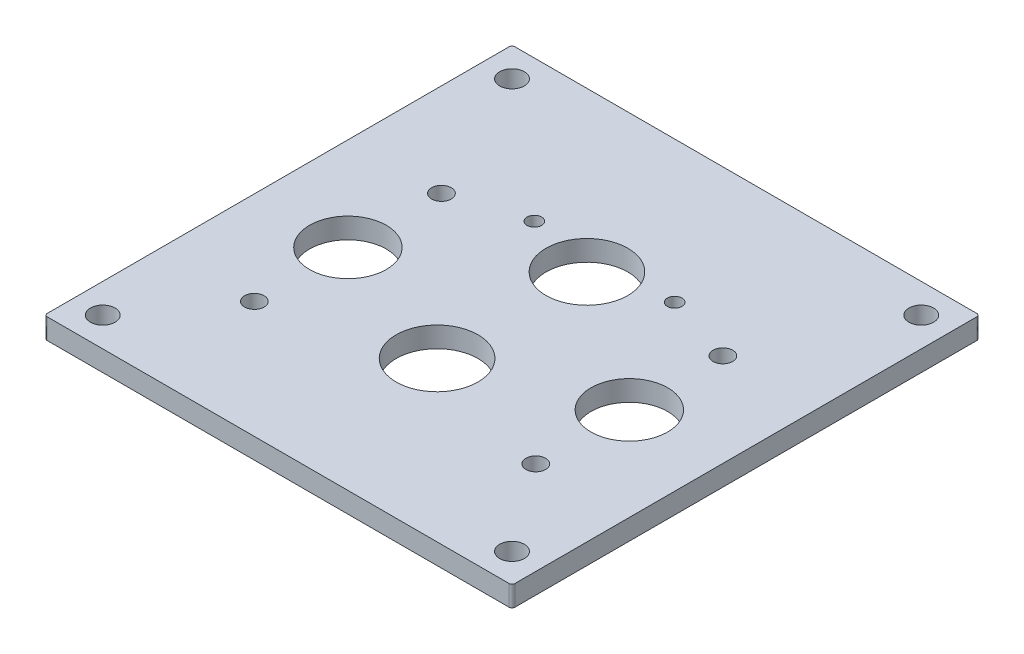
ISO-10303-21;
HEADER;
FILE_DESCRIPTION(('STEP AP214'),'2;1');
FILE_NAME('part.step','',(''),(''),'','','');
FILE_SCHEMA(('AUTOMOTIVE_DESIGN { 1 0 10303 214 1 1 1 1 }'));
ENDSEC;
DATA;
#1=APPLICATION_CONTEXT('core data for automotive mechanical design processes');
#2=APPLICATION_PROTOCOL_DEFINITION('international standard','automotive_design',2000,#1);
#3=PRODUCT_CONTEXT('',#1,'mechanical');
#4=PRODUCT('Part','Part','',(#3));
#5=PRODUCT_RELATED_PRODUCT_CATEGORY('part','',(#4));
#6=PRODUCT_DEFINITION_FORMATION('','',#4);
#7=PRODUCT_DEFINITION_CONTEXT('part definition',#1,'design');
#8=PRODUCT_DEFINITION('design','',#6,#7);
#9=PRODUCT_DEFINITION_SHAPE('','',#8);
#10=(LENGTH_UNIT() NAMED_UNIT(*) SI_UNIT(.MILLI.,.METRE.));
#11=(NAMED_UNIT(*) PLANE_ANGLE_UNIT() SI_UNIT($,.RADIAN.));
#12=(NAMED_UNIT(*) SI_UNIT($,.STERADIAN.) SOLID_ANGLE_UNIT());
#13=UNCERTAINTY_MEASURE_WITH_UNIT(LENGTH_MEASURE(1.E-05),#10,'distance_accuracy_value','');
#14=(GEOMETRIC_REPRESENTATION_CONTEXT(3) GLOBAL_UNCERTAINTY_ASSIGNED_CONTEXT((#13)) GLOBAL_UNIT_ASSIGNED_CONTEXT((#10,
#11,#12)) REPRESENTATION_CONTEXT('',''));
#15=CARTESIAN_POINT('',(0.,0.,0.));
#16=DIRECTION('',(0.,0.,1.));
#17=DIRECTION('',(1.,0.,0.));
#18=AXIS2_PLACEMENT_3D('',#15,#16,#17);
#19=CARTESIAN_POINT('',(76.3793482367759,0.,47.8960232997481));
#20=DIRECTION('',(0.,-1.,0.));
#21=DIRECTION('',(0.,0.,-1.));
#22=AXIS2_PLACEMENT_3D('',#19,#20,#21);
#23=CYLINDRICAL_SURFACE('',#22,0.793749999999989);
#24=CARTESIAN_POINT('',(76.3793482367759,0.,47.8960232997481));
#25=DIRECTION('',(0.,-1.,0.));
#26=DIRECTION('',(0.,0.,-1.));
#27=AXIS2_PLACEMENT_3D('',#24,#25,#26);
#28=CIRCLE('',#27,0.793749999999989);
#29=CARTESIAN_POINT('',(77.1730982367758,0.,47.8960232997481));
#30=VERTEX_POINT('',#29);
#31=CARTESIAN_POINT('',(76.3793482367759,0.,48.6897732997481));
#32=VERTEX_POINT('',#31);
#33=EDGE_CURVE('E85',#30,#32,#28,.T.);
#34=ORIENTED_EDGE('',*,*,#33,.T.);
#35=DIRECTION('',(0.,1.,0.));
#36=VECTOR('',#35,1.);
#37=CARTESIAN_POINT('',(76.3793482367759,0.,48.6897732997481));
#38=LINE('',#37,#36);
#39=CARTESIAN_POINT('',(76.3793482367759,-5.588,48.6897732997481));
#40=VERTEX_POINT('',#39);
#41=EDGE_CURVE('E120',#40,#32,#38,.T.);
#42=ORIENTED_EDGE('',*,*,#41,.F.);
#43=CARTESIAN_POINT('',(76.3793482367759,-5.588,47.8960232997481));
#44=DIRECTION('',(0.,-1.,0.));
#45=DIRECTION('',(0.,0.,-1.));
#46=AXIS2_PLACEMENT_3D('',#43,#44,#45);
#47=CIRCLE('',#46,0.793749999999989);
#48=CARTESIAN_POINT('',(77.1730982367758,-5.588,47.8960232997481));
#49=VERTEX_POINT('',#48);
#50=EDGE_CURVE('E20',#40,#49,#47,.F.);
#51=ORIENTED_EDGE('',*,*,#50,.T.);
#52=DIRECTION('',(0.,1.,0.));
#53=VECTOR('',#52,1.);
#54=CARTESIAN_POINT('',(77.1730982367758,0.,47.8960232997481));
#55=LINE('',#54,#53);
#56=EDGE_CURVE('E106',#30,#49,#55,.F.);
#57=ORIENTED_EDGE('',*,*,#56,.F.);
#58=EDGE_LOOP('',(#34,#42,#51,#57));
#59=FACE_BOUND('',#58,.T.);
#60=ADVANCED_FACE('F17',(#59),#23,.T.);
#61=CARTESIAN_POINT('',(-49.0331517632242,0.,47.8960232997481));
#62=DIRECTION('',(0.,-1.,0.));
#63=DIRECTION('',(0.,0.,-1.));
#64=AXIS2_PLACEMENT_3D('',#61,#62,#63);
#65=CYLINDRICAL_SURFACE('',#64,0.79375000000001);
#66=CARTESIAN_POINT('',(-49.0331517632242,0.,47.8960232997481));
#67=DIRECTION('',(0.,-1.,0.));
#68=DIRECTION('',(0.,0.,-1.));
#69=AXIS2_PLACEMENT_3D('',#66,#67,#68);
#70=CIRCLE('',#69,0.79375000000001);
#71=CARTESIAN_POINT('',(-49.0331517632242,0.,48.6897732997481));
#72=VERTEX_POINT('',#71);
#73=CARTESIAN_POINT('',(-49.8269017632242,0.,47.8960232997481));
#74=VERTEX_POINT('',#73);
#75=EDGE_CURVE('E214',#72,#74,#70,.T.);
#76=ORIENTED_EDGE('',*,*,#75,.T.);
#77=DIRECTION('',(0.,1.,0.));
#78=VECTOR('',#77,1.);
#79=CARTESIAN_POINT('',(-49.8269017632242,0.,47.8960232997481));
#80=LINE('',#79,#78);
#81=CARTESIAN_POINT('',(-49.8269017632242,-5.588,47.8960232997481));
#82=VERTEX_POINT('',#81);
#83=EDGE_CURVE('E128',#82,#74,#80,.T.);
#84=ORIENTED_EDGE('',*,*,#83,.F.);
#85=CARTESIAN_POINT('',(-49.0331517632242,-5.588,47.8960232997481));
#86=DIRECTION('',(0.,-1.,0.));
#87=DIRECTION('',(0.,0.,-1.));
#88=AXIS2_PLACEMENT_3D('',#85,#86,#87);
#89=CIRCLE('',#88,0.79375000000001);
#90=CARTESIAN_POINT('',(-49.0331517632242,-5.588,48.6897732997481));
#91=VERTEX_POINT('',#90);
#92=EDGE_CURVE('E217',#82,#91,#89,.F.);
#93=ORIENTED_EDGE('',*,*,#92,.T.);
#94=DIRECTION('',(0.,1.,0.));
#95=VECTOR('',#94,1.);
#96=CARTESIAN_POINT('',(-49.0331517632242,0.,48.6897732997481));
#97=LINE('',#96,#95);
#98=EDGE_CURVE('E117',#72,#91,#97,.F.);
#99=ORIENTED_EDGE('',*,*,#98,.F.);
#100=EDGE_LOOP('',(#76,#84,#93,#99));
#101=FACE_BOUND('',#100,.T.);
#102=ADVANCED_FACE('F222',(#101),#65,.T.);
#103=CARTESIAN_POINT('',(-49.0331517632242,0.,-77.5164767002519));
#104=DIRECTION('',(0.,-1.,0.));
#105=DIRECTION('',(0.,0.,-1.));
#106=AXIS2_PLACEMENT_3D('',#103,#104,#105);
#107=CYLINDRICAL_SURFACE('',#106,0.793749999999996);
#108=CARTESIAN_POINT('',(-49.0331517632242,0.,-77.5164767002519));
#109=DIRECTION('',(0.,-1.,0.));
#110=DIRECTION('',(0.,0.,-1.));
#111=AXIS2_PLACEMENT_3D('',#108,#109,#110);
#112=CIRCLE('',#111,0.793749999999996);
#113=CARTESIAN_POINT('',(-49.8269017632242,0.,-77.5164767002519));
#114=VERTEX_POINT('',#113);
#115=CARTESIAN_POINT('',(-49.0331517632242,0.,-78.3102267002519));
#116=VERTEX_POINT('',#115);
#117=EDGE_CURVE('E212',#114,#116,#112,.T.);
#118=ORIENTED_EDGE('',*,*,#117,.T.);
#119=DIRECTION('',(0.,1.,0.));
#120=VECTOR('',#119,1.);
#121=CARTESIAN_POINT('',(-49.0331517632242,0.,-78.3102267002519));
#122=LINE('',#121,#120);
#123=CARTESIAN_POINT('',(-49.0331517632242,-5.588,-78.3102267002519));
#124=VERTEX_POINT('',#123);
#125=EDGE_CURVE('E123',#124,#116,#122,.T.);
#126=ORIENTED_EDGE('',*,*,#125,.F.);
#127=CARTESIAN_POINT('',(-49.0331517632242,-5.588,-77.5164767002519));
#128=DIRECTION('',(0.,-1.,0.));
#129=DIRECTION('',(0.,0.,-1.));
#130=AXIS2_PLACEMENT_3D('',#127,#128,#129);
#131=CIRCLE('',#130,0.793749999999996);
#132=CARTESIAN_POINT('',(-49.8269017632242,-5.588,-77.5164767002519));
#133=VERTEX_POINT('',#132);
#134=EDGE_CURVE('E34',#124,#133,#131,.F.);
#135=ORIENTED_EDGE('',*,*,#134,.T.);
#136=DIRECTION('',(0.,1.,0.));
#137=VECTOR('',#136,1.);
#138=CARTESIAN_POINT('',(-49.8269017632242,0.,-77.5164767002519));
#139=LINE('',#138,#137);
#140=EDGE_CURVE('E127',#114,#133,#139,.F.);
#141=ORIENTED_EDGE('',*,*,#140,.F.);
#142=EDGE_LOOP('',(#118,#126,#135,#141));
#143=FACE_BOUND('',#142,.T.);
#144=ADVANCED_FACE('F246',(#143),#107,.T.);
#145=CARTESIAN_POINT('',(76.3793482367759,0.,-77.5164767002519));
#146=DIRECTION('',(0.,-1.,0.));
#147=DIRECTION('',(0.,0.,-1.));
#148=AXIS2_PLACEMENT_3D('',#145,#146,#147);
#149=PLANE('',#148);
#150=DIRECTION('',(-1.,0.,0.));
#151=VECTOR('',#150,1.);
#152=CARTESIAN_POINT('',(-49.0331517632242,0.,-78.3102267002519));
#153=LINE('',#152,#151);
#154=CARTESIAN_POINT('',(76.3793482367759,0.,-78.3102267002519));
#155=VERTEX_POINT('',#154);
#156=EDGE_CURVE('E121',#116,#155,#153,.F.);
#157=ORIENTED_EDGE('',*,*,#156,.F.);
#158=ORIENTED_EDGE('',*,*,#117,.F.);
#159=DIRECTION('',(0.,0.,1.));
#160=VECTOR('',#159,1.);
#161=CARTESIAN_POINT('',(-49.8269017632242,0.,47.8960232997481));
#162=LINE('',#161,#160);
#163=EDGE_CURVE('E124',#74,#114,#162,.F.);
#164=ORIENTED_EDGE('',*,*,#163,.F.);
#165=ORIENTED_EDGE('',*,*,#75,.F.);
#166=DIRECTION('',(1.,0.,0.));
#167=VECTOR('',#166,1.);
#168=CARTESIAN_POINT('',(76.3793482367759,0.,48.6897732997481));
#169=LINE('',#168,#167);
#170=EDGE_CURVE('E129',#32,#72,#169,.F.);
#171=ORIENTED_EDGE('',*,*,#170,.F.);
#172=ORIENTED_EDGE('',*,*,#33,.F.);
#173=DIRECTION('',(0.,0.,-1.));
#174=VECTOR('',#173,1.);
#175=CARTESIAN_POINT('',(77.1730982367758,0.,-77.5164767002519));
#176=LINE('',#175,#174);
#177=CARTESIAN_POINT('',(77.1730982367758,0.,-77.5164767002519));
#178=VERTEX_POINT('',#177);
#179=EDGE_CURVE('E102',#178,#30,#176,.F.);
#180=ORIENTED_EDGE('',*,*,#179,.F.);
#181=CARTESIAN_POINT('',(76.3793482367759,0.,-77.5164767002519));
#182=DIRECTION('',(0.,-1.,0.));
#183=DIRECTION('',(0.,0.,-1.));
#184=AXIS2_PLACEMENT_3D('',#181,#182,#183);
#185=CIRCLE('',#184,0.793749999999996);
#186=EDGE_CURVE('E90',#155,#178,#185,.T.);
#187=ORIENTED_EDGE('',*,*,#186,.F.);
#188=EDGE_LOOP('',(#157,#158,#164,#165,#171,#172,#180,#187));
#189=FACE_BOUND('',#188,.T.);
#190=CARTESIAN_POINT('',(-5.37690176322416,0.,-39.9181267002519));
#191=DIRECTION('',(0.,-1.,0.));
#192=DIRECTION('',(0.,0.,-1.));
#193=AXIS2_PLACEMENT_3D('',#190,#191,#192);
#194=CIRCLE('',#193,1.98374);
#195=CARTESIAN_POINT('',(-5.37690176322416,0.,-41.9018667002519));
#196=VERTEX_POINT('',#195);
#197=EDGE_CURVE('E110',#196,#196,#194,.T.);
#198=ORIENTED_EDGE('',*,*,#197,.T.);
#199=EDGE_LOOP('',(#198));
#200=FACE_BOUND('',#199,.T.);
#201=CARTESIAN_POINT('',(32.7230982367758,0.,-39.9181267002519));
#202=DIRECTION('',(0.,-1.,0.));
#203=DIRECTION('',(0.,0.,-1.));
#204=AXIS2_PLACEMENT_3D('',#201,#202,#203);
#205=CIRCLE('',#204,1.98374);
#206=CARTESIAN_POINT('',(32.7230982367758,0.,-41.9018667002519));
#207=VERTEX_POINT('',#206);
#208=EDGE_CURVE('E113',#207,#207,#205,.T.);
#209=ORIENTED_EDGE('',*,*,#208,.T.);
#210=EDGE_LOOP('',(#209));
#211=FACE_BOUND('',#210,.T.);
#212=CARTESIAN_POINT('',(51.8813432040601,0.,-33.8602267002519));
#213=DIRECTION('',(0.,-1.,0.));
#214=DIRECTION('',(0.,0.,-1.));
#215=AXIS2_PLACEMENT_3D('',#212,#213,#214);
#216=CIRCLE('',#215,2.667);
#217=CARTESIAN_POINT('',(51.8813432040601,0.,-36.5272267002519));
#218=VERTEX_POINT('',#217);
#219=EDGE_CURVE('E176',#218,#218,#216,.T.);
#220=ORIENTED_EDGE('',*,*,#219,.T.);
#221=EDGE_LOOP('',(#220));
#222=FACE_BOUND('',#221,.T.);
#223=CARTESIAN_POINT('',(-41.8894017632242,0.,40.7522732997481));
#224=DIRECTION('',(0.,-1.,0.));
#225=DIRECTION('',(0.,0.,-1.));
#226=AXIS2_PLACEMENT_3D('',#223,#224,#225);
#227=CIRCLE('',#226,3.3528);
#228=CARTESIAN_POINT('',(-41.8894017632242,0.,37.3994732997481));
#229=VERTEX_POINT('',#228);
#230=EDGE_CURVE('E179',#229,#229,#227,.T.);
#231=ORIENTED_EDGE('',*,*,#230,.T.);
#232=EDGE_LOOP('',(#231));
#233=FACE_BOUND('',#232,.T.);
#234=CARTESIAN_POINT('',(13.6730982367758,0.,5.53517329974811));
#235=DIRECTION('',(0.,-1.,0.));
#236=DIRECTION('',(0.,0.,-1.));
#237=AXIS2_PLACEMENT_3D('',#234,#235,#236);
#238=CIRCLE('',#237,11.1125);
#239=CARTESIAN_POINT('',(13.6730982367758,0.,-5.57732670025189));
#240=VERTEX_POINT('',#239);
#241=EDGE_CURVE('E182',#240,#240,#238,.T.);
#242=ORIENTED_EDGE('',*,*,#241,.T.);
#243=EDGE_LOOP('',(#242));
#244=FACE_BOUND('',#243,.T.);
#245=CARTESIAN_POINT('',(69.2355982367759,0.,-70.3727267002519));
#246=DIRECTION('',(0.,-1.,0.));
#247=DIRECTION('',(0.,0.,-1.));
#248=AXIS2_PLACEMENT_3D('',#245,#246,#247);
#249=CIRCLE('',#248,3.3528);
#250=CARTESIAN_POINT('',(69.2355982367759,0.,-73.7255267002519));
#251=VERTEX_POINT('',#250);
#252=EDGE_CURVE('E185',#251,#251,#249,.T.);
#253=ORIENTED_EDGE('',*,*,#252,.T.);
#254=EDGE_LOOP('',(#253));
#255=FACE_BOUND('',#254,.T.);
#256=CARTESIAN_POINT('',(69.2355982367758,0.,40.7522732997481));
#257=DIRECTION('',(0.,-1.,0.));
#258=DIRECTION('',(0.,0.,-1.));
#259=AXIS2_PLACEMENT_3D('',#256,#257,#258);
#260=CIRCLE('',#259,3.3528);
#261=CARTESIAN_POINT('',(69.2355982367758,0.,37.3994732997481));
#262=VERTEX_POINT('',#261);
#263=EDGE_CURVE('E188',#262,#262,#260,.T.);
#264=ORIENTED_EDGE('',*,*,#263,.T.);
#265=EDGE_LOOP('',(#264));
#266=FACE_BOUND('',#265,.T.);
#267=CARTESIAN_POINT('',(-41.8894017632242,0.,-70.3727267002519));
#268=DIRECTION('',(0.,-1.,0.));
#269=DIRECTION('',(0.,0.,-1.));
#270=AXIS2_PLACEMENT_3D('',#267,#268,#269);
#271=CIRCLE('',#270,3.3528);
#272=CARTESIAN_POINT('',(-41.8894017632242,0.,-73.7255267002519));
#273=VERTEX_POINT('',#272);
#274=EDGE_CURVE('E191',#273,#273,#271,.T.);
#275=ORIENTED_EDGE('',*,*,#274,.T.);
#276=EDGE_LOOP('',(#275));
#277=FACE_BOUND('',#276,.T.);
#278=CARTESIAN_POINT('',(13.6730982367758,0.,-35.1556267002519));
#279=DIRECTION('',(0.,-1.,0.));
#280=DIRECTION('',(0.,0.,-1.));
#281=AXIS2_PLACEMENT_3D('',#278,#279,#280);
#282=CIRCLE('',#281,11.1125);
#283=CARTESIAN_POINT('',(13.6730982367758,0.,-46.2681267002519));
#284=VERTEX_POINT('',#283);
#285=EDGE_CURVE('E194',#284,#284,#282,.T.);
#286=ORIENTED_EDGE('',*,*,#285,.T.);
#287=EDGE_LOOP('',(#286));
#288=FACE_BOUND('',#287,.T.);
#289=CARTESIAN_POINT('',(51.8813432040601,0.,16.9397732997481));
#290=DIRECTION('',(0.,-1.,0.));
#291=DIRECTION('',(0.,0.,-1.));
#292=AXIS2_PLACEMENT_3D('',#289,#290,#291);
#293=CIRCLE('',#292,2.667);
#294=CARTESIAN_POINT('',(51.8813432040601,0.,14.2727732997481));
#295=VERTEX_POINT('',#294);
#296=EDGE_CURVE('E197',#295,#295,#293,.T.);
#297=ORIENTED_EDGE('',*,*,#296,.T.);
#298=EDGE_LOOP('',(#297));
#299=FACE_BOUND('',#298,.T.);
#300=CARTESIAN_POINT('',(-24.5351467305084,0.,-8.4602267002519));
#301=DIRECTION('',(0.,-1.,0.));
#302=DIRECTION('',(0.,0.,-1.));
#303=AXIS2_PLACEMENT_3D('',#300,#301,#302);
#304=CIRCLE('',#303,10.414);
#305=CARTESIAN_POINT('',(-24.5351467305084,0.,-18.8742267002519));
#306=VERTEX_POINT('',#305);
#307=EDGE_CURVE('E200',#306,#306,#304,.T.);
#308=ORIENTED_EDGE('',*,*,#307,.T.);
#309=EDGE_LOOP('',(#308));
#310=FACE_BOUND('',#309,.T.);
#311=CARTESIAN_POINT('',(-24.5351467305084,0.,16.9397732997481));
#312=DIRECTION('',(0.,-1.,0.));
#313=DIRECTION('',(0.,0.,-1.));
#314=AXIS2_PLACEMENT_3D('',#311,#312,#313);
#315=CIRCLE('',#314,2.667);
#316=CARTESIAN_POINT('',(-24.5351467305084,0.,14.2727732997481));
#317=VERTEX_POINT('',#316);
#318=EDGE_CURVE('E203',#317,#317,#315,.T.);
#319=ORIENTED_EDGE('',*,*,#318,.T.);
#320=EDGE_LOOP('',(#319));
#321=FACE_BOUND('',#320,.T.);
#322=CARTESIAN_POINT('',(-24.5351467305084,0.,-33.8602267002519));
#323=DIRECTION('',(0.,-1.,0.));
#324=DIRECTION('',(0.,0.,-1.));
#325=AXIS2_PLACEMENT_3D('',#322,#323,#324);
#326=CIRCLE('',#325,2.667);
#327=CARTESIAN_POINT('',(-24.5351467305084,0.,-36.5272267002519));
#328=VERTEX_POINT('',#327);
#329=EDGE_CURVE('E206',#328,#328,#326,.T.);
#330=ORIENTED_EDGE('',*,*,#329,.T.);
#331=EDGE_LOOP('',(#330));
#332=FACE_BOUND('',#331,.T.);
#333=CARTESIAN_POINT('',(51.8813432040601,0.,-8.4602267002519));
#334=DIRECTION('',(0.,-1.,0.));
#335=DIRECTION('',(0.,0.,-1.));
#336=AXIS2_PLACEMENT_3D('',#333,#334,#335);
#337=CIRCLE('',#336,10.414);
#338=CARTESIAN_POINT('',(51.8813432040601,0.,-18.8742267002519));
#339=VERTEX_POINT('',#338);
#340=EDGE_CURVE('E99',#339,#339,#337,.T.);
#341=ORIENTED_EDGE('',*,*,#340,.T.);
#342=EDGE_LOOP('',(#341));
#343=FACE_BOUND('',#342,.T.);
#344=ADVANCED_FACE('F103',(#189,#200,#211,#222,#233,#244,#255,#266,#277,#288,#299,#310,#321,
#332,#343),#149,.F.);
#345=CARTESIAN_POINT('',(76.3793482367759,0.,-77.5164767002519));
#346=DIRECTION('',(0.,-1.,0.));
#347=DIRECTION('',(0.,0.,-1.));
#348=AXIS2_PLACEMENT_3D('',#345,#346,#347);
#349=CYLINDRICAL_SURFACE('',#348,0.793749999999996);
#350=ORIENTED_EDGE('',*,*,#186,.T.);
#351=DIRECTION('',(0.,1.,0.));
#352=VECTOR('',#351,1.);
#353=CARTESIAN_POINT('',(77.1730982367758,0.,-77.5164767002519));
#354=LINE('',#353,#352);
#355=CARTESIAN_POINT('',(77.1730982367758,-5.588,-77.5164767002519));
#356=VERTEX_POINT('',#355);
#357=EDGE_CURVE('E93',#356,#178,#354,.T.);
#358=ORIENTED_EDGE('',*,*,#357,.F.);
#359=CARTESIAN_POINT('',(76.3793482367759,-5.588,-77.5164767002519));
#360=DIRECTION('',(0.,-1.,0.));
#361=DIRECTION('',(0.,0.,-1.));
#362=AXIS2_PLACEMENT_3D('',#359,#360,#361);
#363=CIRCLE('',#362,0.793749999999996);
#364=CARTESIAN_POINT('',(76.3793482367759,-5.588,-78.3102267002519));
#365=VERTEX_POINT('',#364);
#366=EDGE_CURVE('E60',#356,#365,#363,.F.);
#367=ORIENTED_EDGE('',*,*,#366,.T.);
#368=DIRECTION('',(0.,1.,0.));
#369=VECTOR('',#368,1.);
#370=CARTESIAN_POINT('',(76.3793482367759,0.,-78.3102267002519));
#371=LINE('',#370,#369);
#372=EDGE_CURVE('E96',#155,#365,#371,.F.);
#373=ORIENTED_EDGE('',*,*,#372,.F.);
#374=EDGE_LOOP('',(#350,#358,#367,#373));
#375=FACE_BOUND('',#374,.T.);
#376=ADVANCED_FACE('F91',(#375),#349,.T.);
#377=CARTESIAN_POINT('',(51.8813432040601,0.,-8.4602267002519));
#378=DIRECTION('',(0.,-1.,0.));
#379=DIRECTION('',(0.,0.,-1.));
#380=AXIS2_PLACEMENT_3D('',#377,#378,#379);
#381=CYLINDRICAL_SURFACE('',#380,10.414);
#382=CARTESIAN_POINT('',(51.8813432040601,-5.588,-8.4602267002519));
#383=DIRECTION('',(0.,-1.,0.));
#384=DIRECTION('',(0.,0.,-1.));
#385=AXIS2_PLACEMENT_3D('',#382,#383,#384);
#386=CIRCLE('',#385,10.414);
#387=CARTESIAN_POINT('',(51.8813432040601,-5.588,-18.8742267002519));
#388=VERTEX_POINT('',#387);
#389=EDGE_CURVE('E171',#388,#388,#386,.F.);
#390=ORIENTED_EDGE('',*,*,#389,.F.);
#391=EDGE_LOOP('',(#390));
#392=FACE_BOUND('',#391,.T.);
#393=ORIENTED_EDGE('',*,*,#340,.F.);
#394=EDGE_LOOP('',(#393));
#395=FACE_BOUND('',#394,.T.);
#396=ADVANCED_FACE('F315',(#392,#395),#381,.F.);
#397=CARTESIAN_POINT('',(-24.5351467305084,0.,-33.8602267002519));
#398=DIRECTION('',(0.,-1.,0.));
#399=DIRECTION('',(0.,0.,-1.));
#400=AXIS2_PLACEMENT_3D('',#397,#398,#399);
#401=CYLINDRICAL_SURFACE('',#400,2.667);
#402=CARTESIAN_POINT('',(-24.5351467305084,-5.588,-33.8602267002519));
#403=DIRECTION('',(0.,-1.,0.));
#404=DIRECTION('',(0.,0.,-1.));
#405=AXIS2_PLACEMENT_3D('',#402,#403,#404);
#406=CIRCLE('',#405,2.667);
#407=CARTESIAN_POINT('',(-24.5351467305084,-5.588,-36.5272267002519));
#408=VERTEX_POINT('',#407);
#409=EDGE_CURVE('E168',#408,#408,#406,.F.);
#410=ORIENTED_EDGE('',*,*,#409,.F.);
#411=EDGE_LOOP('',(#410));
#412=FACE_BOUND('',#411,.T.);
#413=ORIENTED_EDGE('',*,*,#329,.F.);
#414=EDGE_LOOP('',(#413));
#415=FACE_BOUND('',#414,.T.);
#416=ADVANCED_FACE('F311',(#412,#415),#401,.F.);
#417=CARTESIAN_POINT('',(-24.5351467305084,0.,16.9397732997481));
#418=DIRECTION('',(0.,-1.,0.));
#419=DIRECTION('',(0.,0.,-1.));
#420=AXIS2_PLACEMENT_3D('',#417,#418,#419);
#421=CYLINDRICAL_SURFACE('',#420,2.667);
#422=CARTESIAN_POINT('',(-24.5351467305084,-5.588,16.9397732997481));
#423=DIRECTION('',(0.,-1.,0.));
#424=DIRECTION('',(0.,0.,-1.));
#425=AXIS2_PLACEMENT_3D('',#422,#423,#424);
#426=CIRCLE('',#425,2.667);
#427=CARTESIAN_POINT('',(-24.5351467305084,-5.588,14.2727732997481));
#428=VERTEX_POINT('',#427);
#429=EDGE_CURVE('E165',#428,#428,#426,.F.);
#430=ORIENTED_EDGE('',*,*,#429,.F.);
#431=EDGE_LOOP('',(#430));
#432=FACE_BOUND('',#431,.T.);
#433=ORIENTED_EDGE('',*,*,#318,.F.);
#434=EDGE_LOOP('',(#433));
#435=FACE_BOUND('',#434,.T.);
#436=ADVANCED_FACE('F307',(#432,#435),#421,.F.);
#437=CARTESIAN_POINT('',(-24.5351467305084,0.,-8.4602267002519));
#438=DIRECTION('',(0.,-1.,0.));
#439=DIRECTION('',(0.,0.,-1.));
#440=AXIS2_PLACEMENT_3D('',#437,#438,#439);
#441=CYLINDRICAL_SURFACE('',#440,10.414);
#442=CARTESIAN_POINT('',(-24.5351467305084,-5.588,-8.4602267002519));
#443=DIRECTION('',(0.,-1.,0.));
#444=DIRECTION('',(0.,0.,-1.));
#445=AXIS2_PLACEMENT_3D('',#442,#443,#444);
#446=CIRCLE('',#445,10.414);
#447=CARTESIAN_POINT('',(-24.5351467305084,-5.588,-18.8742267002519));
#448=VERTEX_POINT('',#447);
#449=EDGE_CURVE('E162',#448,#448,#446,.F.);
#450=ORIENTED_EDGE('',*,*,#449,.F.);
#451=EDGE_LOOP('',(#450));
#452=FACE_BOUND('',#451,.T.);
#453=ORIENTED_EDGE('',*,*,#307,.F.);
#454=EDGE_LOOP('',(#453));
#455=FACE_BOUND('',#454,.T.);
#456=ADVANCED_FACE('F303',(#452,#455),#441,.F.);
#457=CARTESIAN_POINT('',(51.8813432040601,0.,16.9397732997481));
#458=DIRECTION('',(0.,-1.,0.));
#459=DIRECTION('',(0.,0.,-1.));
#460=AXIS2_PLACEMENT_3D('',#457,#458,#459);
#461=CYLINDRICAL_SURFACE('',#460,2.667);
#462=CARTESIAN_POINT('',(51.8813432040601,-5.588,16.9397732997481));
#463=DIRECTION('',(0.,-1.,0.));
#464=DIRECTION('',(0.,0.,-1.));
#465=AXIS2_PLACEMENT_3D('',#462,#463,#464);
#466=CIRCLE('',#465,2.667);
#467=CARTESIAN_POINT('',(51.8813432040601,-5.588,14.2727732997481));
#468=VERTEX_POINT('',#467);
#469=EDGE_CURVE('E159',#468,#468,#466,.F.);
#470=ORIENTED_EDGE('',*,*,#469,.F.);
#471=EDGE_LOOP('',(#470));
#472=FACE_BOUND('',#471,.T.);
#473=ORIENTED_EDGE('',*,*,#296,.F.);
#474=EDGE_LOOP('',(#473));
#475=FACE_BOUND('',#474,.T.);
#476=ADVANCED_FACE('F299',(#472,#475),#461,.F.);
#477=CARTESIAN_POINT('',(13.6730982367758,0.,-35.1556267002519));
#478=DIRECTION('',(0.,-1.,0.));
#479=DIRECTION('',(0.,0.,-1.));
#480=AXIS2_PLACEMENT_3D('',#477,#478,#479);
#481=CYLINDRICAL_SURFACE('',#480,11.1125);
#482=CARTESIAN_POINT('',(13.6730982367758,-5.588,-35.1556267002519));
#483=DIRECTION('',(0.,-1.,0.));
#484=DIRECTION('',(0.,0.,-1.));
#485=AXIS2_PLACEMENT_3D('',#482,#483,#484);
#486=CIRCLE('',#485,11.1125);
#487=CARTESIAN_POINT('',(13.6730982367758,-5.588,-46.2681267002519));
#488=VERTEX_POINT('',#487);
#489=EDGE_CURVE('E156',#488,#488,#486,.F.);
#490=ORIENTED_EDGE('',*,*,#489,.F.);
#491=EDGE_LOOP('',(#490));
#492=FACE_BOUND('',#491,.T.);
#493=ORIENTED_EDGE('',*,*,#285,.F.);
#494=EDGE_LOOP('',(#493));
#495=FACE_BOUND('',#494,.T.);
#496=ADVANCED_FACE('F295',(#492,#495),#481,.F.);
#497=CARTESIAN_POINT('',(-41.8894017632242,0.,-70.3727267002519));
#498=DIRECTION('',(0.,-1.,0.));
#499=DIRECTION('',(0.,0.,-1.));
#500=AXIS2_PLACEMENT_3D('',#497,#498,#499);
#501=CYLINDRICAL_SURFACE('',#500,3.3528);
#502=CARTESIAN_POINT('',(-41.8894017632242,-5.588,-70.3727267002519));
#503=DIRECTION('',(0.,-1.,0.));
#504=DIRECTION('',(0.,0.,-1.));
#505=AXIS2_PLACEMENT_3D('',#502,#503,#504);
#506=CIRCLE('',#505,3.3528);
#507=CARTESIAN_POINT('',(-41.8894017632242,-5.588,-73.7255267002519));
#508=VERTEX_POINT('',#507);
#509=EDGE_CURVE('E153',#508,#508,#506,.F.);
#510=ORIENTED_EDGE('',*,*,#509,.F.);
#511=EDGE_LOOP('',(#510));
#512=FACE_BOUND('',#511,.T.);
#513=ORIENTED_EDGE('',*,*,#274,.F.);
#514=EDGE_LOOP('',(#513));
#515=FACE_BOUND('',#514,.T.);
#516=ADVANCED_FACE('F291',(#512,#515),#501,.F.);
#517=CARTESIAN_POINT('',(69.2355982367758,0.,40.7522732997481));
#518=DIRECTION('',(0.,-1.,0.));
#519=DIRECTION('',(0.,0.,-1.));
#520=AXIS2_PLACEMENT_3D('',#517,#518,#519);
#521=CYLINDRICAL_SURFACE('',#520,3.3528);
#522=CARTESIAN_POINT('',(69.2355982367758,-5.588,40.7522732997481));
#523=DIRECTION('',(0.,-1.,0.));
#524=DIRECTION('',(0.,0.,-1.));
#525=AXIS2_PLACEMENT_3D('',#522,#523,#524);
#526=CIRCLE('',#525,3.3528);
#527=CARTESIAN_POINT('',(69.2355982367758,-5.588,37.3994732997481));
#528=VERTEX_POINT('',#527);
#529=EDGE_CURVE('E150',#528,#528,#526,.F.);
#530=ORIENTED_EDGE('',*,*,#529,.F.);
#531=EDGE_LOOP('',(#530));
#532=FACE_BOUND('',#531,.T.);
#533=ORIENTED_EDGE('',*,*,#263,.F.);
#534=EDGE_LOOP('',(#533));
#535=FACE_BOUND('',#534,.T.);
#536=ADVANCED_FACE('F287',(#532,#535),#521,.F.);
#537=CARTESIAN_POINT('',(69.2355982367759,0.,-70.3727267002519));
#538=DIRECTION('',(0.,-1.,0.));
#539=DIRECTION('',(0.,0.,-1.));
#540=AXIS2_PLACEMENT_3D('',#537,#538,#539);
#541=CYLINDRICAL_SURFACE('',#540,3.3528);
#542=CARTESIAN_POINT('',(69.2355982367759,-5.588,-70.3727267002519));
#543=DIRECTION('',(0.,-1.,0.));
#544=DIRECTION('',(0.,0.,-1.));
#545=AXIS2_PLACEMENT_3D('',#542,#543,#544);
#546=CIRCLE('',#545,3.3528);
#547=CARTESIAN_POINT('',(69.2355982367759,-5.588,-73.7255267002519));
#548=VERTEX_POINT('',#547);
#549=EDGE_CURVE('E147',#548,#548,#546,.F.);
#550=ORIENTED_EDGE('',*,*,#549,.F.);
#551=EDGE_LOOP('',(#550));
#552=FACE_BOUND('',#551,.T.);
#553=ORIENTED_EDGE('',*,*,#252,.F.);
#554=EDGE_LOOP('',(#553));
#555=FACE_BOUND('',#554,.T.);
#556=ADVANCED_FACE('F283',(#552,#555),#541,.F.);
#557=CARTESIAN_POINT('',(13.6730982367758,0.,5.53517329974811));
#558=DIRECTION('',(0.,-1.,0.));
#559=DIRECTION('',(0.,0.,-1.));
#560=AXIS2_PLACEMENT_3D('',#557,#558,#559);
#561=CYLINDRICAL_SURFACE('',#560,11.1125);
#562=CARTESIAN_POINT('',(13.6730982367758,-5.588,5.53517329974811));
#563=DIRECTION('',(0.,-1.,0.));
#564=DIRECTION('',(0.,0.,-1.));
#565=AXIS2_PLACEMENT_3D('',#562,#563,#564);
#566=CIRCLE('',#565,11.1125);
#567=CARTESIAN_POINT('',(13.6730982367758,-5.588,-5.57732670025189));
#568=VERTEX_POINT('',#567);
#569=EDGE_CURVE('E144',#568,#568,#566,.F.);
#570=ORIENTED_EDGE('',*,*,#569,.F.);
#571=EDGE_LOOP('',(#570));
#572=FACE_BOUND('',#571,.T.);
#573=ORIENTED_EDGE('',*,*,#241,.F.);
#574=EDGE_LOOP('',(#573));
#575=FACE_BOUND('',#574,.T.);
#576=ADVANCED_FACE('F279',(#572,#575),#561,.F.);
#577=CARTESIAN_POINT('',(-41.8894017632242,0.,40.7522732997481));
#578=DIRECTION('',(0.,-1.,0.));
#579=DIRECTION('',(0.,0.,-1.));
#580=AXIS2_PLACEMENT_3D('',#577,#578,#579);
#581=CYLINDRICAL_SURFACE('',#580,3.3528);
#582=CARTESIAN_POINT('',(-41.8894017632242,-5.588,40.7522732997481));
#583=DIRECTION('',(0.,-1.,0.));
#584=DIRECTION('',(0.,0.,-1.));
#585=AXIS2_PLACEMENT_3D('',#582,#583,#584);
#586=CIRCLE('',#585,3.3528);
#587=CARTESIAN_POINT('',(-41.8894017632242,-5.588,37.3994732997481));
#588=VERTEX_POINT('',#587);
#589=EDGE_CURVE('E141',#588,#588,#586,.F.);
#590=ORIENTED_EDGE('',*,*,#589,.F.);
#591=EDGE_LOOP('',(#590));
#592=FACE_BOUND('',#591,.T.);
#593=ORIENTED_EDGE('',*,*,#230,.F.);
#594=EDGE_LOOP('',(#593));
#595=FACE_BOUND('',#594,.T.);
#596=ADVANCED_FACE('F275',(#592,#595),#581,.F.);
#597=CARTESIAN_POINT('',(51.8813432040601,0.,-33.8602267002519));
#598=DIRECTION('',(0.,-1.,0.));
#599=DIRECTION('',(0.,0.,-1.));
#600=AXIS2_PLACEMENT_3D('',#597,#598,#599);
#601=CYLINDRICAL_SURFACE('',#600,2.667);
#602=CARTESIAN_POINT('',(51.8813432040601,-5.588,-33.8602267002519));
#603=DIRECTION('',(0.,-1.,0.));
#604=DIRECTION('',(0.,0.,-1.));
#605=AXIS2_PLACEMENT_3D('',#602,#603,#604);
#606=CIRCLE('',#605,2.667);
#607=CARTESIAN_POINT('',(51.8813432040601,-5.588,-36.5272267002519));
#608=VERTEX_POINT('',#607);
#609=EDGE_CURVE('E138',#608,#608,#606,.F.);
#610=ORIENTED_EDGE('',*,*,#609,.F.);
#611=EDGE_LOOP('',(#610));
#612=FACE_BOUND('',#611,.T.);
#613=ORIENTED_EDGE('',*,*,#219,.F.);
#614=EDGE_LOOP('',(#613));
#615=FACE_BOUND('',#614,.T.);
#616=ADVANCED_FACE('F271',(#612,#615),#601,.F.);
#617=CARTESIAN_POINT('',(32.7230982367758,0.,-39.9181267002519));
#618=DIRECTION('',(0.,-1.,0.));
#619=DIRECTION('',(0.,0.,-1.));
#620=AXIS2_PLACEMENT_3D('',#617,#618,#619);
#621=CYLINDRICAL_SURFACE('',#620,1.98374);
#622=CARTESIAN_POINT('',(32.7230982367758,-5.588,-39.9181267002519));
#623=DIRECTION('',(0.,-1.,0.));
#624=DIRECTION('',(0.,0.,-1.));
#625=AXIS2_PLACEMENT_3D('',#622,#623,#624);
#626=CIRCLE('',#625,1.98374);
#627=CARTESIAN_POINT('',(32.7230982367758,-5.588,-41.9018667002519));
#628=VERTEX_POINT('',#627);
#629=EDGE_CURVE('E135',#628,#628,#626,.F.);
#630=ORIENTED_EDGE('',*,*,#629,.F.);
#631=EDGE_LOOP('',(#630));
#632=FACE_BOUND('',#631,.T.);
#633=ORIENTED_EDGE('',*,*,#208,.F.);
#634=EDGE_LOOP('',(#633));
#635=FACE_BOUND('',#634,.T.);
#636=ADVANCED_FACE('F267',(#632,#635),#621,.F.);
#637=CARTESIAN_POINT('',(-5.37690176322416,0.,-39.9181267002519));
#638=DIRECTION('',(0.,-1.,0.));
#639=DIRECTION('',(0.,0.,-1.));
#640=AXIS2_PLACEMENT_3D('',#637,#638,#639);
#641=CYLINDRICAL_SURFACE('',#640,1.98374);
#642=CARTESIAN_POINT('',(-5.37690176322416,-5.588,-39.9181267002519));
#643=DIRECTION('',(0.,-1.,0.));
#644=DIRECTION('',(0.,0.,-1.));
#645=AXIS2_PLACEMENT_3D('',#642,#643,#644);
#646=CIRCLE('',#645,1.98374);
#647=CARTESIAN_POINT('',(-5.37690176322416,-5.588,-41.9018667002519));
#648=VERTEX_POINT('',#647);
#649=EDGE_CURVE('E132',#648,#648,#646,.F.);
#650=ORIENTED_EDGE('',*,*,#649,.F.);
#651=EDGE_LOOP('',(#650));
#652=FACE_BOUND('',#651,.T.);
#653=ORIENTED_EDGE('',*,*,#197,.F.);
#654=EDGE_LOOP('',(#653));
#655=FACE_BOUND('',#654,.T.);
#656=ADVANCED_FACE('F264',(#652,#655),#641,.F.);
#657=CARTESIAN_POINT('',(77.1730982367758,0.,-77.5164767002519));
#658=DIRECTION('',(1.,0.,0.));
#659=DIRECTION('',(0.,0.,-1.));
#660=AXIS2_PLACEMENT_3D('',#657,#658,#659);
#661=PLANE('',#660);
#662=ORIENTED_EDGE('',*,*,#179,.T.);
#663=ORIENTED_EDGE('',*,*,#56,.T.);
#664=DIRECTION('',(0.,0.,-1.));
#665=VECTOR('',#664,1.);
#666=CARTESIAN_POINT('',(77.1730982367758,-5.588,-77.5164767002519));
#667=LINE('',#666,#665);
#668=EDGE_CURVE('E109',#356,#49,#667,.F.);
#669=ORIENTED_EDGE('',*,*,#668,.F.);
#670=ORIENTED_EDGE('',*,*,#357,.T.);
#671=EDGE_LOOP('',(#662,#663,#669,#670));
#672=FACE_BOUND('',#671,.T.);
#673=ADVANCED_FACE('F108',(#672),#661,.T.);
#674=CARTESIAN_POINT('',(76.3793482367759,0.,48.6897732997481));
#675=DIRECTION('',(0.,0.,1.));
#676=DIRECTION('',(1.,0.,0.));
#677=AXIS2_PLACEMENT_3D('',#674,#675,#676);
#678=PLANE('',#677);
#679=ORIENTED_EDGE('',*,*,#170,.T.);
#680=ORIENTED_EDGE('',*,*,#98,.T.);
#681=DIRECTION('',(1.,0.,0.));
#682=VECTOR('',#681,1.);
#683=CARTESIAN_POINT('',(76.3793482367759,-5.588,48.6897732997481));
#684=LINE('',#683,#682);
#685=EDGE_CURVE('E229',#40,#91,#684,.F.);
#686=ORIENTED_EDGE('',*,*,#685,.F.);
#687=ORIENTED_EDGE('',*,*,#41,.T.);
#688=EDGE_LOOP('',(#679,#680,#686,#687));
#689=FACE_BOUND('',#688,.T.);
#690=ADVANCED_FACE('F227',(#689),#678,.T.);
#691=CARTESIAN_POINT('',(-49.8269017632242,0.,47.8960232997481));
#692=DIRECTION('',(-1.,0.,0.));
#693=DIRECTION('',(0.,0.,1.));
#694=AXIS2_PLACEMENT_3D('',#691,#692,#693);
#695=PLANE('',#694);
#696=ORIENTED_EDGE('',*,*,#163,.T.);
#697=ORIENTED_EDGE('',*,*,#140,.T.);
#698=DIRECTION('',(0.,0.,-1.));
#699=VECTOR('',#698,1.);
#700=CARTESIAN_POINT('',(-49.8269017632242,-5.588,-77.5164767002519));
#701=LINE('',#700,#699);
#702=EDGE_CURVE('E26',#82,#133,#701,.T.);
#703=ORIENTED_EDGE('',*,*,#702,.F.);
#704=ORIENTED_EDGE('',*,*,#83,.T.);
#705=EDGE_LOOP('',(#696,#697,#703,#704));
#706=FACE_BOUND('',#705,.T.);
#707=ADVANCED_FACE('F244',(#706),#695,.T.);
#708=CARTESIAN_POINT('',(-49.0331517632242,0.,-78.3102267002519));
#709=DIRECTION('',(0.,0.,-1.));
#710=DIRECTION('',(-1.,0.,0.));
#711=AXIS2_PLACEMENT_3D('',#708,#709,#710);
#712=PLANE('',#711);
#713=ORIENTED_EDGE('',*,*,#156,.T.);
#714=ORIENTED_EDGE('',*,*,#372,.T.);
#715=DIRECTION('',(1.,0.,0.));
#716=VECTOR('',#715,1.);
#717=CARTESIAN_POINT('',(76.3793482367759,-5.588,-78.3102267002519));
#718=LINE('',#717,#716);
#719=EDGE_CURVE('E11',#124,#365,#718,.T.);
#720=ORIENTED_EDGE('',*,*,#719,.F.);
#721=ORIENTED_EDGE('',*,*,#125,.T.);
#722=EDGE_LOOP('',(#713,#714,#720,#721));
#723=FACE_BOUND('',#722,.T.);
#724=ADVANCED_FACE('F249',(#723),#712,.T.);
#725=CARTESIAN_POINT('',(76.3793482367759,-5.588,-77.5164767002519));
#726=DIRECTION('',(0.,-1.,0.));
#727=DIRECTION('',(0.,0.,-1.));
#728=AXIS2_PLACEMENT_3D('',#725,#726,#727);
#729=PLANE('',#728);
#730=ORIENTED_EDGE('',*,*,#134,.F.);
#731=ORIENTED_EDGE('',*,*,#719,.T.);
#732=ORIENTED_EDGE('',*,*,#366,.F.);
#733=ORIENTED_EDGE('',*,*,#668,.T.);
#734=ORIENTED_EDGE('',*,*,#50,.F.);
#735=ORIENTED_EDGE('',*,*,#685,.T.);
#736=ORIENTED_EDGE('',*,*,#92,.F.);
#737=ORIENTED_EDGE('',*,*,#702,.T.);
#738=EDGE_LOOP('',(#730,#731,#732,#733,#734,#735,#736,#737));
#739=FACE_BOUND('',#738,.T.);
#740=ORIENTED_EDGE('',*,*,#649,.T.);
#741=EDGE_LOOP('',(#740));
#742=FACE_BOUND('',#741,.T.);
#743=ORIENTED_EDGE('',*,*,#629,.T.);
#744=EDGE_LOOP('',(#743));
#745=FACE_BOUND('',#744,.T.);
#746=ORIENTED_EDGE('',*,*,#609,.T.);
#747=EDGE_LOOP('',(#746));
#748=FACE_BOUND('',#747,.T.);
#749=ORIENTED_EDGE('',*,*,#589,.T.);
#750=EDGE_LOOP('',(#749));
#751=FACE_BOUND('',#750,.T.);
#752=ORIENTED_EDGE('',*,*,#569,.T.);
#753=EDGE_LOOP('',(#752));
#754=FACE_BOUND('',#753,.T.);
#755=ORIENTED_EDGE('',*,*,#549,.T.);
#756=EDGE_LOOP('',(#755));
#757=FACE_BOUND('',#756,.T.);
#758=ORIENTED_EDGE('',*,*,#529,.T.);
#759=EDGE_LOOP('',(#758));
#760=FACE_BOUND('',#759,.T.);
#761=ORIENTED_EDGE('',*,*,#509,.T.);
#762=EDGE_LOOP('',(#761));
#763=FACE_BOUND('',#762,.T.);
#764=ORIENTED_EDGE('',*,*,#489,.T.);
#765=EDGE_LOOP('',(#764));
#766=FACE_BOUND('',#765,.T.);
#767=ORIENTED_EDGE('',*,*,#469,.T.);
#768=EDGE_LOOP('',(#767));
#769=FACE_BOUND('',#768,.T.);
#770=ORIENTED_EDGE('',*,*,#449,.T.);
#771=EDGE_LOOP('',(#770));
#772=FACE_BOUND('',#771,.T.);
#773=ORIENTED_EDGE('',*,*,#429,.T.);
#774=EDGE_LOOP('',(#773));
#775=FACE_BOUND('',#774,.T.);
#776=ORIENTED_EDGE('',*,*,#409,.T.);
#777=EDGE_LOOP('',(#776));
#778=FACE_BOUND('',#777,.T.);
#779=ORIENTED_EDGE('',*,*,#389,.T.);
#780=EDGE_LOOP('',(#779));
#781=FACE_BOUND('',#780,.T.);
#782=ADVANCED_FACE('F230',(#739,#742,#745,#748,#751,#754,#757,#760,#763,#766,#769,#772,#775,
#778,#781),#729,.T.);
#783=CLOSED_SHELL('',(#60,#102,#144,#344,#376,#396,#416,#436,#456,#476,#496,#516,#536,#556,#576,
#596,#616,#636,#656,#673,#690,#707,#724,#782));
#784=MANIFOLD_SOLID_BREP('B1',#783);
#785=ADVANCED_BREP_SHAPE_REPRESENTATION('',(#18,#784),#14);
#786=SHAPE_DEFINITION_REPRESENTATION(#9,#785);
ENDSEC;
END-ISO-10303-21;
